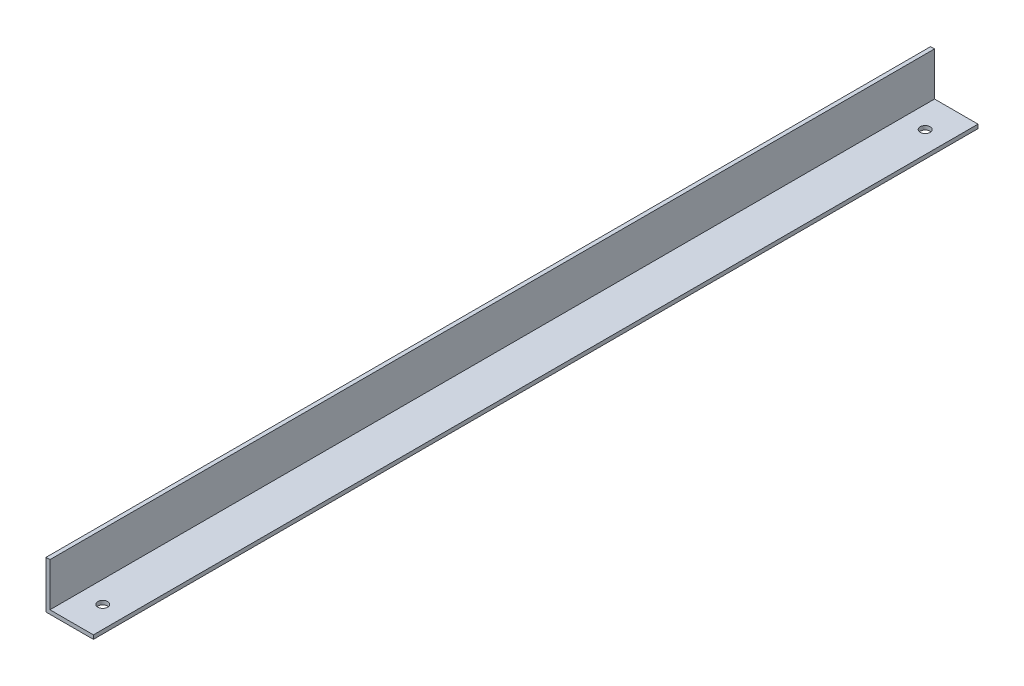
ISO-10303-21;
HEADER;
FILE_DESCRIPTION(('STEP AP214'),'2;1');
FILE_NAME('part.step','',(''),(''),'','','');
FILE_SCHEMA(('AUTOMOTIVE_DESIGN { 1 0 10303 214 1 1 1 1 }'));
ENDSEC;
DATA;
#1=APPLICATION_CONTEXT('core data for automotive mechanical design processes');
#2=APPLICATION_PROTOCOL_DEFINITION('international standard','automotive_design',2000,#1);
#3=PRODUCT_CONTEXT('',#1,'mechanical');
#4=PRODUCT('Part','Part','',(#3));
#5=PRODUCT_RELATED_PRODUCT_CATEGORY('part','',(#4));
#6=PRODUCT_DEFINITION_FORMATION('','',#4);
#7=PRODUCT_DEFINITION_CONTEXT('part definition',#1,'design');
#8=PRODUCT_DEFINITION('design','',#6,#7);
#9=PRODUCT_DEFINITION_SHAPE('','',#8);
#10=(LENGTH_UNIT() NAMED_UNIT(*) SI_UNIT(.MILLI.,.METRE.));
#11=(NAMED_UNIT(*) PLANE_ANGLE_UNIT() SI_UNIT($,.RADIAN.));
#12=(NAMED_UNIT(*) SI_UNIT($,.STERADIAN.) SOLID_ANGLE_UNIT());
#13=UNCERTAINTY_MEASURE_WITH_UNIT(LENGTH_MEASURE(1.E-05),#10,'distance_accuracy_value','');
#14=(GEOMETRIC_REPRESENTATION_CONTEXT(3) GLOBAL_UNCERTAINTY_ASSIGNED_CONTEXT((#13)) GLOBAL_UNIT_ASSIGNED_CONTEXT((#10,
#11,#12)) REPRESENTATION_CONTEXT('',''));
#15=CARTESIAN_POINT('',(0.,0.,0.));
#16=DIRECTION('',(0.,0.,1.));
#17=DIRECTION('',(1.,0.,0.));
#18=AXIS2_PLACEMENT_3D('',#15,#16,#17);
#19=CARTESIAN_POINT('',(19.05,-7.9375,355.6));
#20=DIRECTION('',(-1.,0.,0.));
#21=DIRECTION('',(0.,-1.,0.));
#22=AXIS2_PLACEMENT_3D('',#19,#20,#21);
#23=PLANE('',#22);
#24=DIRECTION('',(0.,1.,0.));
#25=VECTOR('',#24,1.);
#26=CARTESIAN_POINT('',(19.05,-7.9375,0.));
#27=LINE('',#26,#25);
#28=CARTESIAN_POINT('',(19.05,-9.52500000000001,0.));
#29=VERTEX_POINT('',#28);
#30=CARTESIAN_POINT('',(19.05,-7.9375,0.));
#31=VERTEX_POINT('',#30);
#32=EDGE_CURVE('E118',#29,#31,#27,.T.);
#33=ORIENTED_EDGE('',*,*,#32,.T.);
#34=DIRECTION('',(0.,0.,-1.));
#35=VECTOR('',#34,1.);
#36=CARTESIAN_POINT('',(19.05,-7.9375,355.6));
#37=LINE('',#36,#35);
#38=CARTESIAN_POINT('',(19.05,-7.9375,355.6));
#39=VERTEX_POINT('',#38);
#40=EDGE_CURVE('E11',#39,#31,#37,.T.);
#41=ORIENTED_EDGE('',*,*,#40,.F.);
#42=DIRECTION('',(0.,1.,0.));
#43=VECTOR('',#42,1.);
#44=CARTESIAN_POINT('',(19.05,-7.9375,355.6));
#45=LINE('',#44,#43);
#46=CARTESIAN_POINT('',(19.05,-9.52500000000001,355.6));
#47=VERTEX_POINT('',#46);
#48=EDGE_CURVE('E129',#47,#39,#45,.T.);
#49=ORIENTED_EDGE('',*,*,#48,.F.);
#50=DIRECTION('',(0.,0.,-1.));
#51=VECTOR('',#50,1.);
#52=CARTESIAN_POINT('',(19.05,-9.52500000000001,355.6));
#53=LINE('',#52,#51);
#54=EDGE_CURVE('E114',#47,#29,#53,.T.);
#55=ORIENTED_EDGE('',*,*,#54,.T.);
#56=EDGE_LOOP('',(#33,#41,#49,#55));
#57=FACE_BOUND('',#56,.T.);
#58=ADVANCED_FACE('F34',(#57),#23,.F.);
#59=CARTESIAN_POINT('',(1.5875,-7.9375,355.6));
#60=DIRECTION('',(0.,-1.,0.));
#61=DIRECTION('',(0.,0.,-1.));
#62=AXIS2_PLACEMENT_3D('',#59,#60,#61);
#63=PLANE('',#62);
#64=CARTESIAN_POINT('',(10.31875,-7.9375,12.5));
#65=DIRECTION('',(0.,1.,0.));
#66=DIRECTION('',(0.,0.,1.));
#67=AXIS2_PLACEMENT_3D('',#64,#65,#66);
#68=CIRCLE('',#67,1.984375);
#69=CARTESIAN_POINT('',(10.31875,-7.9375,14.484375));
#70=VERTEX_POINT('',#69);
#71=EDGE_CURVE('E227',#70,#70,#68,.T.);
#72=ORIENTED_EDGE('',*,*,#71,.F.);
#73=EDGE_LOOP('',(#72));
#74=FACE_BOUND('',#73,.T.);
#75=CARTESIAN_POINT('',(10.31875,-7.9375,343.1));
#76=DIRECTION('',(0.,1.,0.));
#77=DIRECTION('',(0.,0.,1.));
#78=AXIS2_PLACEMENT_3D('',#75,#76,#77);
#79=CIRCLE('',#78,1.98437499999999);
#80=CARTESIAN_POINT('',(10.31875,-7.9375,345.084375));
#81=VERTEX_POINT('',#80);
#82=EDGE_CURVE('E232',#81,#81,#79,.T.);
#83=ORIENTED_EDGE('',*,*,#82,.F.);
#84=EDGE_LOOP('',(#83));
#85=FACE_BOUND('',#84,.T.);
#86=DIRECTION('',(-1.,0.,0.));
#87=VECTOR('',#86,1.);
#88=CARTESIAN_POINT('',(1.5875,-7.9375,0.));
#89=LINE('',#88,#87);
#90=CARTESIAN_POINT('',(1.5875,-7.9375,0.));
#91=VERTEX_POINT('',#90);
#92=EDGE_CURVE('E121',#31,#91,#89,.T.);
#93=ORIENTED_EDGE('',*,*,#92,.T.);
#94=DIRECTION('',(0.,0.,-1.));
#95=VECTOR('',#94,1.);
#96=CARTESIAN_POINT('',(1.5875,-7.9375,355.6));
#97=LINE('',#96,#95);
#98=CARTESIAN_POINT('',(1.5875,-7.9375,355.6));
#99=VERTEX_POINT('',#98);
#100=EDGE_CURVE('E42',#99,#91,#97,.T.);
#101=ORIENTED_EDGE('',*,*,#100,.F.);
#102=DIRECTION('',(-1.,0.,0.));
#103=VECTOR('',#102,1.);
#104=CARTESIAN_POINT('',(1.5875,-7.9375,355.6));
#105=LINE('',#104,#103);
#106=EDGE_CURVE('E87',#39,#99,#105,.T.);
#107=ORIENTED_EDGE('',*,*,#106,.F.);
#108=ORIENTED_EDGE('',*,*,#40,.T.);
#109=EDGE_LOOP('',(#93,#101,#107,#108));
#110=FACE_BOUND('',#109,.T.);
#111=ADVANCED_FACE('F156',(#74,#85,#110),#63,.F.);
#112=CARTESIAN_POINT('',(1.5875,9.52500000000001,355.6));
#113=DIRECTION('',(-1.,0.,0.));
#114=DIRECTION('',(0.,-1.,0.));
#115=AXIS2_PLACEMENT_3D('',#112,#113,#114);
#116=PLANE('',#115);
#117=DIRECTION('',(0.,1.,0.));
#118=VECTOR('',#117,1.);
#119=CARTESIAN_POINT('',(1.5875,9.52500000000001,0.));
#120=LINE('',#119,#118);
#121=CARTESIAN_POINT('',(1.5875,9.52500000000001,0.));
#122=VERTEX_POINT('',#121);
#123=EDGE_CURVE('E124',#91,#122,#120,.T.);
#124=ORIENTED_EDGE('',*,*,#123,.T.);
#125=DIRECTION('',(0.,0.,-1.));
#126=VECTOR('',#125,1.);
#127=CARTESIAN_POINT('',(1.5875,9.52500000000001,355.6));
#128=LINE('',#127,#126);
#129=CARTESIAN_POINT('',(1.5875,9.52500000000001,355.6));
#130=VERTEX_POINT('',#129);
#131=EDGE_CURVE('E109',#130,#122,#128,.T.);
#132=ORIENTED_EDGE('',*,*,#131,.F.);
#133=DIRECTION('',(0.,1.,0.));
#134=VECTOR('',#133,1.);
#135=CARTESIAN_POINT('',(1.5875,9.52500000000001,355.6));
#136=LINE('',#135,#134);
#137=EDGE_CURVE('E100',#99,#130,#136,.T.);
#138=ORIENTED_EDGE('',*,*,#137,.F.);
#139=ORIENTED_EDGE('',*,*,#100,.T.);
#140=EDGE_LOOP('',(#124,#132,#138,#139));
#141=FACE_BOUND('',#140,.T.);
#142=ADVANCED_FACE('F135',(#141),#116,.F.);
#143=CARTESIAN_POINT('',(0.,9.52500000000001,355.6));
#144=DIRECTION('',(0.,-1.,0.));
#145=DIRECTION('',(0.,0.,-1.));
#146=AXIS2_PLACEMENT_3D('',#143,#144,#145);
#147=PLANE('',#146);
#148=DIRECTION('',(-1.,0.,0.));
#149=VECTOR('',#148,1.);
#150=CARTESIAN_POINT('',(0.,9.52500000000001,0.));
#151=LINE('',#150,#149);
#152=CARTESIAN_POINT('',(0.,9.52500000000001,0.));
#153=VERTEX_POINT('',#152);
#154=EDGE_CURVE('E108',#122,#153,#151,.T.);
#155=ORIENTED_EDGE('',*,*,#154,.T.);
#156=DIRECTION('',(0.,0.,-1.));
#157=VECTOR('',#156,1.);
#158=CARTESIAN_POINT('',(0.,9.52500000000001,355.6));
#159=LINE('',#158,#157);
#160=CARTESIAN_POINT('',(0.,9.52500000000001,355.6));
#161=VERTEX_POINT('',#160);
#162=EDGE_CURVE('E105',#161,#153,#159,.T.);
#163=ORIENTED_EDGE('',*,*,#162,.F.);
#164=DIRECTION('',(-1.,0.,0.));
#165=VECTOR('',#164,1.);
#166=CARTESIAN_POINT('',(0.,9.52500000000001,355.6));
#167=LINE('',#166,#165);
#168=EDGE_CURVE('E94',#130,#161,#167,.T.);
#169=ORIENTED_EDGE('',*,*,#168,.F.);
#170=ORIENTED_EDGE('',*,*,#131,.T.);
#171=EDGE_LOOP('',(#155,#163,#169,#170));
#172=FACE_BOUND('',#171,.T.);
#173=ADVANCED_FACE('F106',(#172),#147,.F.);
#174=CARTESIAN_POINT('',(0.,-9.52500000000001,355.6));
#175=DIRECTION('',(1.,0.,0.));
#176=DIRECTION('',(0.,1.,0.));
#177=AXIS2_PLACEMENT_3D('',#174,#175,#176);
#178=PLANE('',#177);
#179=DIRECTION('',(0.,-1.,0.));
#180=VECTOR('',#179,1.);
#181=CARTESIAN_POINT('',(0.,-9.52500000000001,0.));
#182=LINE('',#181,#180);
#183=CARTESIAN_POINT('',(0.,-9.52500000000001,0.));
#184=VERTEX_POINT('',#183);
#185=EDGE_CURVE('E73',#153,#184,#182,.T.);
#186=ORIENTED_EDGE('',*,*,#185,.T.);
#187=DIRECTION('',(0.,0.,-1.));
#188=VECTOR('',#187,1.);
#189=CARTESIAN_POINT('',(0.,-9.52500000000001,355.6));
#190=LINE('',#189,#188);
#191=CARTESIAN_POINT('',(0.,-9.52500000000001,355.6));
#192=VERTEX_POINT('',#191);
#193=EDGE_CURVE('E110',#192,#184,#190,.T.);
#194=ORIENTED_EDGE('',*,*,#193,.F.);
#195=DIRECTION('',(0.,-1.,0.));
#196=VECTOR('',#195,1.);
#197=CARTESIAN_POINT('',(0.,-9.52500000000001,355.6));
#198=LINE('',#197,#196);
#199=EDGE_CURVE('E98',#161,#192,#198,.T.);
#200=ORIENTED_EDGE('',*,*,#199,.F.);
#201=ORIENTED_EDGE('',*,*,#162,.T.);
#202=EDGE_LOOP('',(#186,#194,#200,#201));
#203=FACE_BOUND('',#202,.T.);
#204=ADVANCED_FACE('F112',(#203),#178,.F.);
#205=CARTESIAN_POINT('',(19.05,-9.52500000000001,355.6));
#206=DIRECTION('',(0.,1.,0.));
#207=DIRECTION('',(0.,0.,1.));
#208=AXIS2_PLACEMENT_3D('',#205,#206,#207);
#209=PLANE('',#208);
#210=CARTESIAN_POINT('',(10.31875,-9.52500000000001,12.5));
#211=DIRECTION('',(0.,1.,0.));
#212=DIRECTION('',(0.,0.,1.));
#213=AXIS2_PLACEMENT_3D('',#210,#211,#212);
#214=CIRCLE('',#213,1.984375);
#215=CARTESIAN_POINT('',(10.31875,-9.52500000000001,14.484375));
#216=VERTEX_POINT('',#215);
#217=EDGE_CURVE('E122',#216,#216,#214,.F.);
#218=ORIENTED_EDGE('',*,*,#217,.F.);
#219=EDGE_LOOP('',(#218));
#220=FACE_BOUND('',#219,.T.);
#221=CARTESIAN_POINT('',(10.31875,-9.52500000000001,343.1));
#222=DIRECTION('',(0.,1.,0.));
#223=DIRECTION('',(0.,0.,1.));
#224=AXIS2_PLACEMENT_3D('',#221,#222,#223);
#225=CIRCLE('',#224,1.98437499999999);
#226=CARTESIAN_POINT('',(10.31875,-9.52500000000001,345.084375));
#227=VERTEX_POINT('',#226);
#228=EDGE_CURVE('E228',#227,#227,#225,.F.);
#229=ORIENTED_EDGE('',*,*,#228,.F.);
#230=EDGE_LOOP('',(#229));
#231=FACE_BOUND('',#230,.T.);
#232=DIRECTION('',(1.,0.,0.));
#233=VECTOR('',#232,1.);
#234=CARTESIAN_POINT('',(19.05,-9.52500000000001,0.));
#235=LINE('',#234,#233);
#236=EDGE_CURVE('E79',#184,#29,#235,.T.);
#237=ORIENTED_EDGE('',*,*,#236,.T.);
#238=ORIENTED_EDGE('',*,*,#54,.F.);
#239=DIRECTION('',(1.,0.,0.));
#240=VECTOR('',#239,1.);
#241=CARTESIAN_POINT('',(19.05,-9.52500000000001,355.6));
#242=LINE('',#241,#240);
#243=EDGE_CURVE('E50',#192,#47,#242,.T.);
#244=ORIENTED_EDGE('',*,*,#243,.F.);
#245=ORIENTED_EDGE('',*,*,#193,.T.);
#246=EDGE_LOOP('',(#237,#238,#244,#245));
#247=FACE_BOUND('',#246,.T.);
#248=ADVANCED_FACE('F142',(#220,#231,#247),#209,.F.);
#249=CARTESIAN_POINT('',(0.,0.,355.6));
#250=DIRECTION('',(0.,0.,-1.));
#251=DIRECTION('',(-1.,0.,0.));
#252=AXIS2_PLACEMENT_3D('',#249,#250,#251);
#253=PLANE('',#252);
#254=ORIENTED_EDGE('',*,*,#48,.T.);
#255=ORIENTED_EDGE('',*,*,#106,.T.);
#256=ORIENTED_EDGE('',*,*,#137,.T.);
#257=ORIENTED_EDGE('',*,*,#168,.T.);
#258=ORIENTED_EDGE('',*,*,#199,.T.);
#259=ORIENTED_EDGE('',*,*,#243,.T.);
#260=EDGE_LOOP('',(#254,#255,#256,#257,#258,#259));
#261=FACE_BOUND('',#260,.T.);
#262=ADVANCED_FACE('F96',(#261),#253,.F.);
#263=CARTESIAN_POINT('',(0.,0.,0.));
#264=DIRECTION('',(0.,0.,-1.));
#265=DIRECTION('',(-1.,0.,0.));
#266=AXIS2_PLACEMENT_3D('',#263,#264,#265);
#267=PLANE('',#266);
#268=ORIENTED_EDGE('',*,*,#32,.F.);
#269=ORIENTED_EDGE('',*,*,#236,.F.);
#270=ORIENTED_EDGE('',*,*,#185,.F.);
#271=ORIENTED_EDGE('',*,*,#154,.F.);
#272=ORIENTED_EDGE('',*,*,#123,.F.);
#273=ORIENTED_EDGE('',*,*,#92,.F.);
#274=EDGE_LOOP('',(#268,#269,#270,#271,#272,#273));
#275=FACE_BOUND('',#274,.T.);
#276=ADVANCED_FACE('F138',(#275),#267,.T.);
#277=CARTESIAN_POINT('',(10.31875,-15.1376600756682,343.1));
#278=DIRECTION('',(0.,1.,0.));
#279=DIRECTION('',(0.,0.,1.));
#280=AXIS2_PLACEMENT_3D('',#277,#278,#279);
#281=CYLINDRICAL_SURFACE('',#280,1.98437499999999);
#282=ORIENTED_EDGE('',*,*,#228,.T.);
#283=EDGE_LOOP('',(#282));
#284=FACE_BOUND('',#283,.T.);
#285=ORIENTED_EDGE('',*,*,#82,.T.);
#286=EDGE_LOOP('',(#285));
#287=FACE_BOUND('',#286,.T.);
#288=ADVANCED_FACE('F192',(#284,#287),#281,.F.);
#289=CARTESIAN_POINT('',(10.31875,-15.1376600756682,12.5));
#290=DIRECTION('',(0.,1.,0.));
#291=DIRECTION('',(0.,0.,1.));
#292=AXIS2_PLACEMENT_3D('',#289,#290,#291);
#293=CYLINDRICAL_SURFACE('',#292,1.984375);
#294=ORIENTED_EDGE('',*,*,#217,.T.);
#295=EDGE_LOOP('',(#294));
#296=FACE_BOUND('',#295,.T.);
#297=ORIENTED_EDGE('',*,*,#71,.T.);
#298=EDGE_LOOP('',(#297));
#299=FACE_BOUND('',#298,.T.);
#300=ADVANCED_FACE('F210',(#296,#299),#293,.F.);
#301=CLOSED_SHELL('',(#58,#111,#142,#173,#204,#248,#262,#276,#288,#300));
#302=MANIFOLD_SOLID_BREP('B2',#301);
#303=ADVANCED_BREP_SHAPE_REPRESENTATION('',(#18,#302),#14);
#304=SHAPE_DEFINITION_REPRESENTATION(#9,#303);
ENDSEC;
END-ISO-10303-21;
